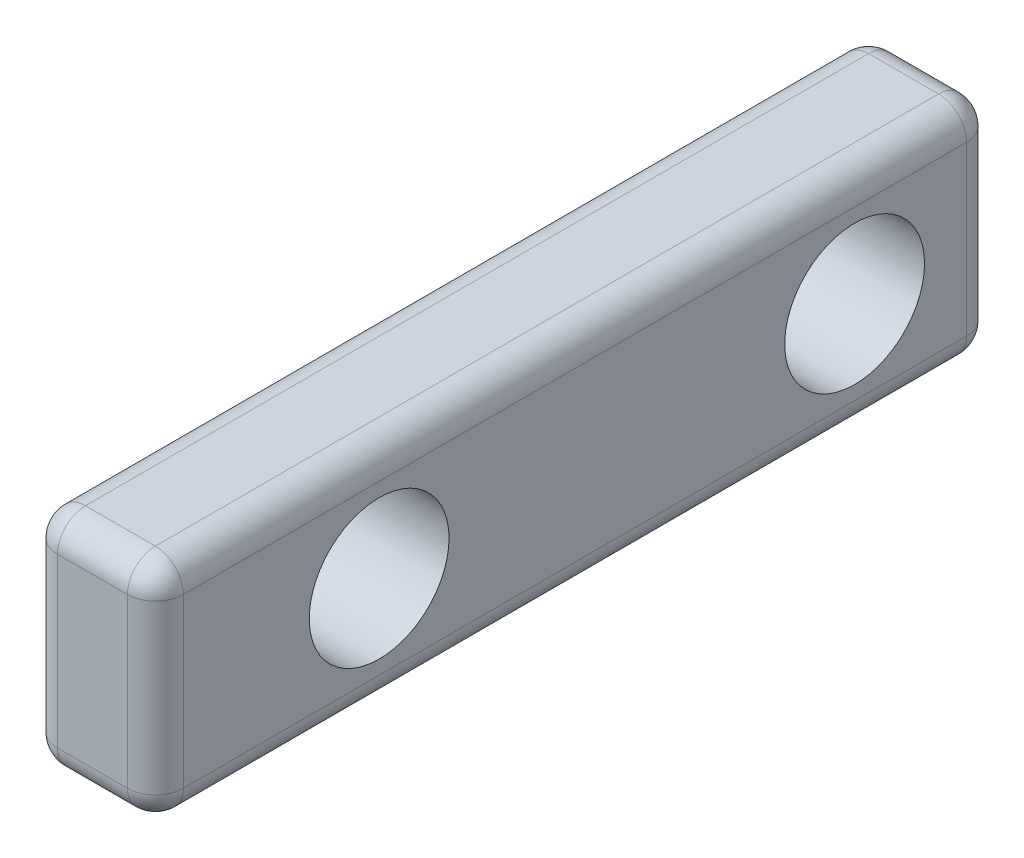
ISO-10303-21;
HEADER;
FILE_DESCRIPTION(('STEP AP214'),'2;1');
FILE_NAME('part.step','',(''),(''),'','','');
FILE_SCHEMA(('AUTOMOTIVE_DESIGN { 1 0 10303 214 1 1 1 1 }'));
ENDSEC;
DATA;
#1=APPLICATION_CONTEXT('core data for automotive mechanical design processes');
#2=APPLICATION_PROTOCOL_DEFINITION('international standard','automotive_design',2000,#1);
#3=PRODUCT_CONTEXT('',#1,'mechanical');
#4=PRODUCT('Part','Part','',(#3));
#5=PRODUCT_RELATED_PRODUCT_CATEGORY('part','',(#4));
#6=PRODUCT_DEFINITION_FORMATION('','',#4);
#7=PRODUCT_DEFINITION_CONTEXT('part definition',#1,'design');
#8=PRODUCT_DEFINITION('design','',#6,#7);
#9=PRODUCT_DEFINITION_SHAPE('','',#8);
#10=(LENGTH_UNIT() NAMED_UNIT(*) SI_UNIT(.MILLI.,.METRE.));
#11=(NAMED_UNIT(*) PLANE_ANGLE_UNIT() SI_UNIT($,.RADIAN.));
#12=(NAMED_UNIT(*) SI_UNIT($,.STERADIAN.) SOLID_ANGLE_UNIT());
#13=UNCERTAINTY_MEASURE_WITH_UNIT(LENGTH_MEASURE(1.E-05),#10,'distance_accuracy_value','');
#14=(GEOMETRIC_REPRESENTATION_CONTEXT(3) GLOBAL_UNCERTAINTY_ASSIGNED_CONTEXT((#13)) GLOBAL_UNIT_ASSIGNED_CONTEXT((#10,
#11,#12)) REPRESENTATION_CONTEXT('',''));
#15=CARTESIAN_POINT('',(0.,0.,0.));
#16=DIRECTION('',(0.,0.,1.));
#17=DIRECTION('',(1.,0.,0.));
#18=AXIS2_PLACEMENT_3D('',#15,#16,#17);
#19=CARTESIAN_POINT('',(0.,8.,30.));
#20=DIRECTION('',(1.,0.,0.));
#21=DIRECTION('',(0.,0.,-1.));
#22=AXIS2_PLACEMENT_3D('',#19,#20,#21);
#23=PLANE('',#22);
#24=CARTESIAN_POINT('',(0.,4.,5.));
#25=DIRECTION('',(-1.,0.,0.));
#26=DIRECTION('',(0.,0.,1.));
#27=AXIS2_PLACEMENT_3D('',#24,#25,#26);
#28=CIRCLE('',#27,3.5);
#29=CARTESIAN_POINT('',(0.,1.,6.802775637732));
#30=VERTEX_POINT('',#29);
#31=CARTESIAN_POINT('',(0.,7.,6.802775637732));
#32=VERTEX_POINT('',#31);
#33=EDGE_CURVE('E454',#30,#32,#28,.T.);
#34=ORIENTED_EDGE('',*,*,#33,.F.);
#35=DIRECTION('',(0.,0.,-1.));
#36=VECTOR('',#35,1.);
#37=CARTESIAN_POINT('',(0.,1.,30.));
#38=LINE('',#37,#36);
#39=CARTESIAN_POINT('',(0.,1.,20.197224362268));
#40=VERTEX_POINT('',#39);
#41=EDGE_CURVE('E206',#30,#40,#38,.F.);
#42=ORIENTED_EDGE('',*,*,#41,.T.);
#43=CARTESIAN_POINT('',(0.,4.,22.));
#44=DIRECTION('',(-1.,0.,0.));
#45=DIRECTION('',(0.,0.,1.));
#46=AXIS2_PLACEMENT_3D('',#43,#44,#45);
#47=CIRCLE('',#46,3.5);
#48=CARTESIAN_POINT('',(0.,7.,20.197224362268));
#49=VERTEX_POINT('',#48);
#50=EDGE_CURVE('E396',#49,#40,#47,.T.);
#51=ORIENTED_EDGE('',*,*,#50,.F.);
#52=DIRECTION('',(0.,0.,-1.));
#53=VECTOR('',#52,1.);
#54=CARTESIAN_POINT('',(0.,7.,30.));
#55=LINE('',#54,#53);
#56=EDGE_CURVE('E198',#49,#32,#55,.T.);
#57=ORIENTED_EDGE('',*,*,#56,.T.);
#58=EDGE_LOOP('',(#34,#42,#51,#57));
#59=FACE_BOUND('',#58,.T.);
#60=ADVANCED_FACE('F39',(#59),#23,.F.);
#61=CARTESIAN_POINT('',(0.,1.,23.802775637732));
#62=VERTEX_POINT('',#61);
#63=CARTESIAN_POINT('',(0.,7.,23.802775637732));
#64=VERTEX_POINT('',#63);
#65=EDGE_CURVE('E391',#62,#64,#47,.T.);
#66=ORIENTED_EDGE('',*,*,#65,.F.);
#67=DIRECTION('',(0.,0.,-1.));
#68=VECTOR('',#67,1.);
#69=CARTESIAN_POINT('',(0.,1.,30.));
#70=LINE('',#69,#68);
#71=CARTESIAN_POINT('',(0.,1.,29.));
#72=VERTEX_POINT('',#71);
#73=EDGE_CURVE('E204',#62,#72,#70,.F.);
#74=ORIENTED_EDGE('',*,*,#73,.T.);
#75=DIRECTION('',(0.,-1.,0.));
#76=VECTOR('',#75,1.);
#77=CARTESIAN_POINT('',(0.,8.,29.));
#78=LINE('',#77,#76);
#79=CARTESIAN_POINT('',(0.,7.,29.));
#80=VERTEX_POINT('',#79);
#81=EDGE_CURVE('E202',#72,#80,#78,.F.);
#82=ORIENTED_EDGE('',*,*,#81,.T.);
#83=DIRECTION('',(0.,0.,-1.));
#84=VECTOR('',#83,1.);
#85=CARTESIAN_POINT('',(0.,7.,30.));
#86=LINE('',#85,#84);
#87=EDGE_CURVE('E200',#80,#64,#86,.T.);
#88=ORIENTED_EDGE('',*,*,#87,.T.);
#89=EDGE_LOOP('',(#66,#74,#82,#88));
#90=FACE_BOUND('',#89,.T.);
#91=ADVANCED_FACE('F305',(#90),#23,.F.);
#92=CARTESIAN_POINT('',(0.,4.,22.));
#93=DIRECTION('',(1.,0.,0.));
#94=DIRECTION('',(0.,0.,-1.));
#95=AXIS2_PLACEMENT_3D('',#92,#93,#94);
#96=CYLINDRICAL_SURFACE('',#95,2.5);
#97=CARTESIAN_POINT('',(4.5,4.,22.));
#98=DIRECTION('',(1.,0.,0.));
#99=DIRECTION('',(0.,0.,-1.));
#100=AXIS2_PLACEMENT_3D('',#97,#98,#99);
#101=CIRCLE('',#100,2.5);
#102=CARTESIAN_POINT('',(4.5,4.,19.5));
#103=VERTEX_POINT('',#102);
#104=EDGE_CURVE('E402',#103,#103,#101,.T.);
#105=ORIENTED_EDGE('',*,*,#104,.T.);
#106=EDGE_LOOP('',(#105));
#107=FACE_BOUND('',#106,.T.);
#108=CARTESIAN_POINT('',(0.5,4.,22.));
#109=DIRECTION('',(-1.,0.,0.));
#110=DIRECTION('',(0.,0.,1.));
#111=AXIS2_PLACEMENT_3D('',#108,#109,#110);
#112=CIRCLE('',#111,2.5);
#113=CARTESIAN_POINT('',(0.5,4.,24.5));
#114=VERTEX_POINT('',#113);
#115=EDGE_CURVE('E405',#114,#114,#112,.F.);
#116=ORIENTED_EDGE('',*,*,#115,.F.);
#117=EDGE_LOOP('',(#116));
#118=FACE_BOUND('',#117,.T.);
#119=ADVANCED_FACE('F310',(#107,#118),#96,.F.);
#120=CARTESIAN_POINT('',(0.,4.,5.));
#121=DIRECTION('',(1.,0.,0.));
#122=DIRECTION('',(0.,0.,-1.));
#123=AXIS2_PLACEMENT_3D('',#120,#121,#122);
#124=CYLINDRICAL_SURFACE('',#123,2.5);
#125=CARTESIAN_POINT('',(4.5,4.,5.));
#126=DIRECTION('',(1.,0.,0.));
#127=DIRECTION('',(0.,0.,-1.));
#128=AXIS2_PLACEMENT_3D('',#125,#126,#127);
#129=CIRCLE('',#128,2.5);
#130=CARTESIAN_POINT('',(4.5,4.,2.5));
#131=VERTEX_POINT('',#130);
#132=EDGE_CURVE('E183',#131,#131,#129,.T.);
#133=ORIENTED_EDGE('',*,*,#132,.T.);
#134=EDGE_LOOP('',(#133));
#135=FACE_BOUND('',#134,.T.);
#136=CARTESIAN_POINT('',(0.5,4.,5.));
#137=DIRECTION('',(-1.,0.,0.));
#138=DIRECTION('',(0.,0.,1.));
#139=AXIS2_PLACEMENT_3D('',#136,#137,#138);
#140=CIRCLE('',#139,2.5);
#141=CARTESIAN_POINT('',(0.5,4.,7.5));
#142=VERTEX_POINT('',#141);
#143=EDGE_CURVE('E406',#142,#142,#140,.F.);
#144=ORIENTED_EDGE('',*,*,#143,.F.);
#145=EDGE_LOOP('',(#144));
#146=FACE_BOUND('',#145,.T.);
#147=ADVANCED_FACE('F314',(#135,#146),#124,.F.);
#148=DIRECTION('',(0.,-1.,0.));
#149=VECTOR('',#148,1.);
#150=CARTESIAN_POINT('',(0.,8.,1.));
#151=LINE('',#150,#149);
#152=CARTESIAN_POINT('',(0.,7.,1.));
#153=VERTEX_POINT('',#152);
#154=CARTESIAN_POINT('',(0.,1.,1.));
#155=VERTEX_POINT('',#154);
#156=EDGE_CURVE('E190',#153,#155,#151,.T.);
#157=ORIENTED_EDGE('',*,*,#156,.T.);
#158=DIRECTION('',(0.,0.,-1.));
#159=VECTOR('',#158,1.);
#160=CARTESIAN_POINT('',(0.,1.,30.));
#161=LINE('',#160,#159);
#162=CARTESIAN_POINT('',(0.,1.,3.197224362268));
#163=VERTEX_POINT('',#162);
#164=EDGE_CURVE('E160',#155,#163,#161,.F.);
#165=ORIENTED_EDGE('',*,*,#164,.T.);
#166=CARTESIAN_POINT('',(0.,7.,3.197224362268));
#167=VERTEX_POINT('',#166);
#168=EDGE_CURVE('E452',#167,#163,#28,.T.);
#169=ORIENTED_EDGE('',*,*,#168,.F.);
#170=DIRECTION('',(0.,0.,-1.));
#171=VECTOR('',#170,1.);
#172=CARTESIAN_POINT('',(0.,7.,30.));
#173=LINE('',#172,#171);
#174=EDGE_CURVE('E195',#167,#153,#173,.T.);
#175=ORIENTED_EDGE('',*,*,#174,.T.);
#176=EDGE_LOOP('',(#157,#165,#169,#175));
#177=FACE_BOUND('',#176,.T.);
#178=ADVANCED_FACE('F261',(#177),#23,.F.);
#179=CARTESIAN_POINT('',(0.,0.,30.));
#180=DIRECTION('',(0.,1.,0.));
#181=DIRECTION('',(0.,0.,1.));
#182=AXIS2_PLACEMENT_3D('',#179,#180,#181);
#183=PLANE('',#182);
#184=DIRECTION('',(0.,0.,-1.));
#185=VECTOR('',#184,1.);
#186=CARTESIAN_POINT('',(3.5,0.,30.));
#187=LINE('',#186,#185);
#188=CARTESIAN_POINT('',(3.5,0.,1.));
#189=VERTEX_POINT('',#188);
#190=CARTESIAN_POINT('',(3.5,0.,29.));
#191=VERTEX_POINT('',#190);
#192=EDGE_CURVE('E182',#189,#191,#187,.F.);
#193=ORIENTED_EDGE('',*,*,#192,.T.);
#194=DIRECTION('',(1.,0.,0.));
#195=VECTOR('',#194,1.);
#196=CARTESIAN_POINT('',(0.,0.,29.));
#197=LINE('',#196,#195);
#198=CARTESIAN_POINT('',(1.,0.,29.));
#199=VERTEX_POINT('',#198);
#200=EDGE_CURVE('E187',#191,#199,#197,.F.);
#201=ORIENTED_EDGE('',*,*,#200,.T.);
#202=DIRECTION('',(0.,0.,-1.));
#203=VECTOR('',#202,1.);
#204=CARTESIAN_POINT('',(1.,0.,30.));
#205=LINE('',#204,#203);
#206=CARTESIAN_POINT('',(1.,0.,1.));
#207=VERTEX_POINT('',#206);
#208=EDGE_CURVE('E158',#199,#207,#205,.T.);
#209=ORIENTED_EDGE('',*,*,#208,.T.);
#210=DIRECTION('',(1.,0.,0.));
#211=VECTOR('',#210,1.);
#212=CARTESIAN_POINT('',(0.,0.,1.));
#213=LINE('',#212,#211);
#214=EDGE_CURVE('E176',#207,#189,#213,.T.);
#215=ORIENTED_EDGE('',*,*,#214,.T.);
#216=EDGE_LOOP('',(#193,#201,#209,#215));
#217=FACE_BOUND('',#216,.T.);
#218=ADVANCED_FACE('F185',(#217),#183,.F.);
#219=CARTESIAN_POINT('',(4.5,8.,30.));
#220=DIRECTION('',(-1.,0.,0.));
#221=DIRECTION('',(0.,-1.,0.));
#222=AXIS2_PLACEMENT_3D('',#219,#220,#221);
#223=PLANE('',#222);
#224=DIRECTION('',(0.,1.,0.));
#225=VECTOR('',#224,1.);
#226=CARTESIAN_POINT('',(4.5,0.,29.));
#227=LINE('',#226,#225);
#228=CARTESIAN_POINT('',(4.5,7.,29.));
#229=VERTEX_POINT('',#228);
#230=CARTESIAN_POINT('',(4.5,1.,29.));
#231=VERTEX_POINT('',#230);
#232=EDGE_CURVE('E438',#229,#231,#227,.F.);
#233=ORIENTED_EDGE('',*,*,#232,.T.);
#234=DIRECTION('',(0.,0.,-1.));
#235=VECTOR('',#234,1.);
#236=CARTESIAN_POINT('',(4.5,1.,30.));
#237=LINE('',#236,#235);
#238=CARTESIAN_POINT('',(4.5,1.,1.));
#239=VERTEX_POINT('',#238);
#240=EDGE_CURVE('E511',#231,#239,#237,.T.);
#241=ORIENTED_EDGE('',*,*,#240,.T.);
#242=DIRECTION('',(0.,1.,0.));
#243=VECTOR('',#242,1.);
#244=CARTESIAN_POINT('',(4.5,8.,1.));
#245=LINE('',#244,#243);
#246=CARTESIAN_POINT('',(4.5,7.,1.));
#247=VERTEX_POINT('',#246);
#248=EDGE_CURVE('E255',#239,#247,#245,.T.);
#249=ORIENTED_EDGE('',*,*,#248,.T.);
#250=DIRECTION('',(0.,0.,-1.));
#251=VECTOR('',#250,1.);
#252=CARTESIAN_POINT('',(4.5,7.,30.));
#253=LINE('',#252,#251);
#254=EDGE_CURVE('E514',#247,#229,#253,.F.);
#255=ORIENTED_EDGE('',*,*,#254,.T.);
#256=EDGE_LOOP('',(#233,#241,#249,#255));
#257=FACE_BOUND('',#256,.T.);
#258=ORIENTED_EDGE('',*,*,#132,.F.);
#259=EDGE_LOOP('',(#258));
#260=FACE_BOUND('',#259,.T.);
#261=ORIENTED_EDGE('',*,*,#104,.F.);
#262=EDGE_LOOP('',(#261));
#263=FACE_BOUND('',#262,.T.);
#264=ADVANCED_FACE('F320',(#257,#260,#263),#223,.F.);
#265=CARTESIAN_POINT('',(0.,8.,30.));
#266=DIRECTION('',(0.,-1.,0.));
#267=DIRECTION('',(0.,0.,-1.));
#268=AXIS2_PLACEMENT_3D('',#265,#266,#267);
#269=PLANE('',#268);
#270=DIRECTION('',(-1.,0.,0.));
#271=VECTOR('',#270,1.);
#272=CARTESIAN_POINT('',(4.5,8.,29.));
#273=LINE('',#272,#271);
#274=CARTESIAN_POINT('',(1.,8.,29.));
#275=VERTEX_POINT('',#274);
#276=CARTESIAN_POINT('',(3.5,8.,29.));
#277=VERTEX_POINT('',#276);
#278=EDGE_CURVE('E490',#275,#277,#273,.F.);
#279=ORIENTED_EDGE('',*,*,#278,.T.);
#280=DIRECTION('',(0.,0.,-1.));
#281=VECTOR('',#280,1.);
#282=CARTESIAN_POINT('',(3.5,8.,30.));
#283=LINE('',#282,#281);
#284=CARTESIAN_POINT('',(3.5,8.,1.));
#285=VERTEX_POINT('',#284);
#286=EDGE_CURVE('E492',#277,#285,#283,.T.);
#287=ORIENTED_EDGE('',*,*,#286,.T.);
#288=DIRECTION('',(-1.,0.,0.));
#289=VECTOR('',#288,1.);
#290=CARTESIAN_POINT('',(0.,8.,1.));
#291=LINE('',#290,#289);
#292=CARTESIAN_POINT('',(1.,8.,1.));
#293=VERTEX_POINT('',#292);
#294=EDGE_CURVE('E481',#285,#293,#291,.T.);
#295=ORIENTED_EDGE('',*,*,#294,.T.);
#296=DIRECTION('',(0.,0.,-1.));
#297=VECTOR('',#296,1.);
#298=CARTESIAN_POINT('',(1.,8.,30.));
#299=LINE('',#298,#297);
#300=EDGE_CURVE('E488',#293,#275,#299,.F.);
#301=ORIENTED_EDGE('',*,*,#300,.T.);
#302=EDGE_LOOP('',(#279,#287,#295,#301));
#303=FACE_BOUND('',#302,.T.);
#304=ADVANCED_FACE('F424',(#303),#269,.F.);
#305=CARTESIAN_POINT('',(0.,0.,30.));
#306=DIRECTION('',(0.,0.,1.));
#307=DIRECTION('',(1.,0.,0.));
#308=AXIS2_PLACEMENT_3D('',#305,#306,#307);
#309=PLANE('',#308);
#310=DIRECTION('',(1.,0.,0.));
#311=VECTOR('',#310,1.);
#312=CARTESIAN_POINT('',(4.5,1.,30.));
#313=LINE('',#312,#311);
#314=CARTESIAN_POINT('',(1.,1.,30.));
#315=VERTEX_POINT('',#314);
#316=CARTESIAN_POINT('',(3.5,1.,30.));
#317=VERTEX_POINT('',#316);
#318=EDGE_CURVE('E474',#315,#317,#313,.T.);
#319=ORIENTED_EDGE('',*,*,#318,.T.);
#320=DIRECTION('',(0.,1.,0.));
#321=VECTOR('',#320,1.);
#322=CARTESIAN_POINT('',(3.5,8.,30.));
#323=LINE('',#322,#321);
#324=CARTESIAN_POINT('',(3.5,7.,30.));
#325=VERTEX_POINT('',#324);
#326=EDGE_CURVE('E478',#317,#325,#323,.T.);
#327=ORIENTED_EDGE('',*,*,#326,.T.);
#328=DIRECTION('',(-1.,0.,0.));
#329=VECTOR('',#328,1.);
#330=CARTESIAN_POINT('',(0.,7.,30.));
#331=LINE('',#330,#329);
#332=CARTESIAN_POINT('',(1.,7.,30.));
#333=VERTEX_POINT('',#332);
#334=EDGE_CURVE('E483',#325,#333,#331,.T.);
#335=ORIENTED_EDGE('',*,*,#334,.T.);
#336=DIRECTION('',(0.,-1.,0.));
#337=VECTOR('',#336,1.);
#338=CARTESIAN_POINT('',(1.,0.,30.));
#339=LINE('',#338,#337);
#340=EDGE_CURVE('E479',#333,#315,#339,.T.);
#341=ORIENTED_EDGE('',*,*,#340,.T.);
#342=EDGE_LOOP('',(#319,#327,#335,#341));
#343=FACE_BOUND('',#342,.T.);
#344=ADVANCED_FACE('F420',(#343),#309,.T.);
#345=CARTESIAN_POINT('',(0.,0.,0.));
#346=DIRECTION('',(0.,0.,1.));
#347=DIRECTION('',(1.,0.,0.));
#348=AXIS2_PLACEMENT_3D('',#345,#346,#347);
#349=PLANE('',#348);
#350=DIRECTION('',(0.,1.,0.));
#351=VECTOR('',#350,1.);
#352=CARTESIAN_POINT('',(3.5,0.,0.));
#353=LINE('',#352,#351);
#354=CARTESIAN_POINT('',(3.5,7.,0.));
#355=VERTEX_POINT('',#354);
#356=CARTESIAN_POINT('',(3.5,1.,0.));
#357=VERTEX_POINT('',#356);
#358=EDGE_CURVE('E48',#355,#357,#353,.F.);
#359=ORIENTED_EDGE('',*,*,#358,.T.);
#360=DIRECTION('',(1.,0.,0.));
#361=VECTOR('',#360,1.);
#362=CARTESIAN_POINT('',(0.,1.,0.));
#363=LINE('',#362,#361);
#364=CARTESIAN_POINT('',(1.,1.,0.));
#365=VERTEX_POINT('',#364);
#366=EDGE_CURVE('E11',#357,#365,#363,.F.);
#367=ORIENTED_EDGE('',*,*,#366,.T.);
#368=DIRECTION('',(0.,-1.,0.));
#369=VECTOR('',#368,1.);
#370=CARTESIAN_POINT('',(1.,0.,0.));
#371=LINE('',#370,#369);
#372=CARTESIAN_POINT('',(1.,7.,0.));
#373=VERTEX_POINT('',#372);
#374=EDGE_CURVE('E328',#365,#373,#371,.F.);
#375=ORIENTED_EDGE('',*,*,#374,.T.);
#376=DIRECTION('',(-1.,0.,0.));
#377=VECTOR('',#376,1.);
#378=CARTESIAN_POINT('',(0.,7.,0.));
#379=LINE('',#378,#377);
#380=EDGE_CURVE('E59',#373,#355,#379,.F.);
#381=ORIENTED_EDGE('',*,*,#380,.T.);
#382=EDGE_LOOP('',(#359,#367,#375,#381));
#383=FACE_BOUND('',#382,.T.);
#384=ADVANCED_FACE('F423',(#383),#349,.F.);
#385=CARTESIAN_POINT('',(0.5,4.,5.));
#386=DIRECTION('',(-1.,0.,0.));
#387=DIRECTION('',(0.,0.,1.));
#388=AXIS2_PLACEMENT_3D('',#385,#386,#387);
#389=PLANE('',#388);
#390=CARTESIAN_POINT('',(0.5,4.,5.));
#391=DIRECTION('',(-1.,0.,0.));
#392=DIRECTION('',(0.,0.,1.));
#393=AXIS2_PLACEMENT_3D('',#390,#391,#392);
#394=CIRCLE('',#393,3.5);
#395=CARTESIAN_POINT('',(0.5,4.,8.5));
#396=VERTEX_POINT('',#395);
#397=EDGE_CURVE('E409',#396,#396,#394,.T.);
#398=ORIENTED_EDGE('',*,*,#397,.T.);
#399=EDGE_LOOP('',(#398));
#400=FACE_BOUND('',#399,.T.);
#401=ORIENTED_EDGE('',*,*,#143,.T.);
#402=EDGE_LOOP('',(#401));
#403=FACE_BOUND('',#402,.T.);
#404=ADVANCED_FACE('F233',(#400,#403),#389,.T.);
#405=CARTESIAN_POINT('',(0.5,4.,5.));
#406=DIRECTION('',(-1.,0.,0.));
#407=DIRECTION('',(0.,0.,1.));
#408=AXIS2_PLACEMENT_3D('',#405,#406,#407);
#409=CYLINDRICAL_SURFACE('',#408,3.5);
#410=ORIENTED_EDGE('',*,*,#397,.F.);
#411=EDGE_LOOP('',(#410));
#412=FACE_BOUND('',#411,.T.);
#413=ORIENTED_EDGE('',*,*,#168,.T.);
#414=CARTESIAN_POINT('',(0.,1.,3.197224362268));
#415=CARTESIAN_POINT('',(4.05951234376222E-05,0.957179579187127,3.2684690276151));
#416=CARTESIAN_POINT('',(0.00274598049350684,0.916954582336867,3.34116816068963));
#417=CARTESIAN_POINT('',(0.0118454243798904,0.841896788586979,3.48896372851402));
#418=CARTESIAN_POINT('',(0.0182344142756212,0.80705666549464,3.56405673544346));
#419=CARTESIAN_POINT('',(0.0331034224374195,0.742703677815045,3.71667708052777));
#420=CARTESIAN_POINT('',(0.0415929400136458,0.713216099665096,3.79421404116378));
#421=CARTESIAN_POINT('',(0.0592180189432897,0.659822188606181,3.95115107227599));
#422=CARTESIAN_POINT('',(0.0683538692138188,0.635918372495684,4.03055196521593));
#423=CARTESIAN_POINT('',(0.086814208205259,0.5916823795177,4.19894613296531));
#424=CARTESIAN_POINT('',(0.096066281667716,0.571945999945479,4.2881049416193));
#425=CARTESIAN_POINT('',(0.112165671160979,0.539478024378625,4.46790107598855));
#426=CARTESIAN_POINT('',(0.119013345539773,0.52674538439688,4.55853817927213));
#427=CARTESIAN_POINT('',(0.129089883719479,0.508444949212294,4.74044369118192));
#428=CARTESIAN_POINT('',(0.132330563646499,0.502853750480257,4.8317090471198));
#429=CARTESIAN_POINT('',(0.134643572713677,0.498837000908929,5.01444797792208));
#430=CARTESIAN_POINT('',(0.133716170026013,0.500410989065478,5.10592153901219));
#431=CARTESIAN_POINT('',(0.127908262985011,0.510624679269247,5.2869897895417));
#432=CARTESIAN_POINT('',(0.123085955252605,0.519160379562508,5.37659235508552));
#433=CARTESIAN_POINT('',(0.110399410923065,0.543062434341128,5.55466900329641));
#434=CARTESIAN_POINT('',(0.102534540760572,0.558430211597633,5.64314284695874));
#435=CARTESIAN_POINT('',(0.0850524538621382,0.595898993138104,5.81863394534421));
#436=CARTESIAN_POINT('',(0.0754321600120079,0.618011867477833,5.90564834462198));
#437=CARTESIAN_POINT('',(0.0560320950073541,0.668844268691254,6.07770726253581));
#438=CARTESIAN_POINT('',(0.046252306287668,0.697564527863665,6.1627515616742));
#439=CARTESIAN_POINT('',(0.0269543891561955,0.7662525346544,6.34293909496165));
#440=CARTESIAN_POINT('',(0.0176874107885601,0.807254250682241,6.43772270752275));
#441=CARTESIAN_POINT('',(0.00758573529076609,0.874971875166249,6.57697675338798));
#442=CARTESIAN_POINT('',(0.00485268858931609,0.898547155739455,6.62285273098284));
#443=CARTESIAN_POINT('',(0.00106228103195127,0.947748945589155,6.71360172410194));
#444=CARTESIAN_POINT('',(6.11361507090593E-06,0.973376902146048,6.75847400291878));
#445=CARTESIAN_POINT('',(0.,1.,6.802775637732));
#446=B_SPLINE_CURVE_WITH_KNOTS('',3,(#414,#415,#416,#417,#418,#419,#420,#421,#422,#423,#424,
#425,#426,#427,#428,#429,#430,#431,#432,#433,#434,#435,#436,#437,#438,#439,#440,#441,#442,#443,
#444,#445),.UNSPECIFIED.,.F.,.F.,(4,2,2,2,2,2,2,2,2,2,2,2,2,2,2,4),(0.,0.249147999335523,
0.497953987739899,0.747906414524426,0.997971287223848,1.27303052638857,1.54804875372407,
1.82216337471817,2.09626035957851,2.36633599500094,2.63646789968819,2.90707795360593,
3.17771801378922,3.48825886857255,3.64314524558775,3.79814180627766),.UNSPECIFIED.);
#447=EDGE_CURVE('E216',#163,#30,#446,.T.);
#448=ORIENTED_EDGE('',*,*,#447,.T.);
#449=ORIENTED_EDGE('',*,*,#33,.T.);
#450=CARTESIAN_POINT('',(0.,7.,6.802775637732));
#451=CARTESIAN_POINT('',(4.05951234379621E-05,7.04282042081287,6.7315309723849));
#452=CARTESIAN_POINT('',(0.00274598049350713,7.08304541766313,6.65883183931037));
#453=CARTESIAN_POINT('',(0.0118454243798905,7.15810321141302,6.51103627148598));
#454=CARTESIAN_POINT('',(0.0182344142756211,7.19294333450536,6.43594326455654));
#455=CARTESIAN_POINT('',(0.0331034224374195,7.25729632218496,6.28332291947224));
#456=CARTESIAN_POINT('',(0.041592940013646,7.28678390033491,6.20578595883622));
#457=CARTESIAN_POINT('',(0.05921801894329,7.34017781139382,6.04884892772402));
#458=CARTESIAN_POINT('',(0.0683538692138189,7.36408162750432,5.96944803478408));
#459=CARTESIAN_POINT('',(0.086814208205259,7.4083176204823,5.80105386703469));
#460=CARTESIAN_POINT('',(0.0960662816677163,7.42805400005452,5.7118950583807));
#461=CARTESIAN_POINT('',(0.112165671160979,7.46052197562138,5.53209892401145));
#462=CARTESIAN_POINT('',(0.119013345539774,7.47325461560312,5.44146182072787));
#463=CARTESIAN_POINT('',(0.12908988371948,7.49155505078771,5.25955630881809));
#464=CARTESIAN_POINT('',(0.1323305636465,7.49714624951974,5.1682909528802));
#465=CARTESIAN_POINT('',(0.134643572713678,7.50116299909107,4.98555202207793));
#466=CARTESIAN_POINT('',(0.133716170026014,7.49958901093452,4.89407846098782));
#467=CARTESIAN_POINT('',(0.127908262985012,7.48937532073075,4.7130102104583));
#468=CARTESIAN_POINT('',(0.123085955252606,7.4808396204375,4.62340764491448));
#469=CARTESIAN_POINT('',(0.110399410923066,7.45693756565888,4.44533099670359));
#470=CARTESIAN_POINT('',(0.102534540760574,7.44156978840237,4.35685715304126));
#471=CARTESIAN_POINT('',(0.0850524538621396,7.4041010068619,4.1813660546558));
#472=CARTESIAN_POINT('',(0.0754321600120092,7.38198813252217,4.09435165537803));
#473=CARTESIAN_POINT('',(0.0560320950073553,7.33115573130875,3.9222927374642));
#474=CARTESIAN_POINT('',(0.0462523062876691,7.30243547213634,3.8372484383258));
#475=CARTESIAN_POINT('',(0.026954389156196,7.2337474653456,3.65706090503835));
#476=CARTESIAN_POINT('',(0.0176874107885601,7.19274574931776,3.56227729247726));
#477=CARTESIAN_POINT('',(0.00758573529076625,7.12502812483375,3.42302324661202));
#478=CARTESIAN_POINT('',(0.00485268858931645,7.10145284426055,3.37714726901716));
#479=CARTESIAN_POINT('',(0.00106228103195177,7.05225105441085,3.28639827589806));
#480=CARTESIAN_POINT('',(6.11361507135414E-06,7.02662309785395,3.24152599708122));
#481=CARTESIAN_POINT('',(0.,7.,3.197224362268));
#482=B_SPLINE_CURVE_WITH_KNOTS('',3,(#450,#451,#452,#453,#454,#455,#456,#457,#458,#459,#460,
#461,#462,#463,#464,#465,#466,#467,#468,#469,#470,#471,#472,#473,#474,#475,#476,#477,#478,#479,
#480,#481),.UNSPECIFIED.,.F.,.F.,(4,2,2,2,2,2,2,2,2,2,2,2,2,2,2,4),(0.,0.249147999335523,
0.497953987739899,0.747906414524425,0.997971287223845,1.27303052638856,1.54804875372407,
1.82216337471817,2.09626035957851,2.36633599500094,2.63646789968819,2.90707795360593,
3.17771801378922,3.48825886857255,3.64314524558775,3.79814180627767),.UNSPECIFIED.);
#483=EDGE_CURVE('E208',#32,#167,#482,.T.);
#484=ORIENTED_EDGE('',*,*,#483,.T.);
#485=EDGE_LOOP('',(#413,#448,#449,#484));
#486=FACE_BOUND('',#485,.T.);
#487=ADVANCED_FACE('F227',(#412,#486),#409,.F.);
#488=CARTESIAN_POINT('',(0.5,4.,22.));
#489=DIRECTION('',(-1.,0.,0.));
#490=DIRECTION('',(0.,0.,1.));
#491=AXIS2_PLACEMENT_3D('',#488,#489,#490);
#492=PLANE('',#491);
#493=CARTESIAN_POINT('',(0.5,4.,22.));
#494=DIRECTION('',(-1.,0.,0.));
#495=DIRECTION('',(0.,0.,1.));
#496=AXIS2_PLACEMENT_3D('',#493,#494,#495);
#497=CIRCLE('',#496,3.5);
#498=CARTESIAN_POINT('',(0.5,4.,25.5));
#499=VERTEX_POINT('',#498);
#500=EDGE_CURVE('E385',#499,#499,#497,.T.);
#501=ORIENTED_EDGE('',*,*,#500,.T.);
#502=EDGE_LOOP('',(#501));
#503=FACE_BOUND('',#502,.T.);
#504=ORIENTED_EDGE('',*,*,#115,.T.);
#505=EDGE_LOOP('',(#504));
#506=FACE_BOUND('',#505,.T.);
#507=ADVANCED_FACE('F232',(#503,#506),#492,.T.);
#508=CARTESIAN_POINT('',(0.5,4.,22.));
#509=DIRECTION('',(-1.,0.,0.));
#510=DIRECTION('',(0.,0.,1.));
#511=AXIS2_PLACEMENT_3D('',#508,#509,#510);
#512=CYLINDRICAL_SURFACE('',#511,3.5);
#513=ORIENTED_EDGE('',*,*,#500,.F.);
#514=EDGE_LOOP('',(#513));
#515=FACE_BOUND('',#514,.T.);
#516=ORIENTED_EDGE('',*,*,#50,.T.);
#517=CARTESIAN_POINT('',(0.,1.,20.197224362268));
#518=CARTESIAN_POINT('',(4.05951234379235E-05,0.957179579187126,20.2684690276151));
#519=CARTESIAN_POINT('',(0.00274598049350705,0.916954582336866,20.3411681606896));
#520=CARTESIAN_POINT('',(0.0118454243798904,0.841896788586978,20.488963728514));
#521=CARTESIAN_POINT('',(0.018234414275621,0.80705666549464,20.5640567354435));
#522=CARTESIAN_POINT('',(0.0331034224374197,0.742703677815044,20.7166770805278));
#523=CARTESIAN_POINT('',(0.0415929400136464,0.713216099665094,20.7942140411638));
#524=CARTESIAN_POINT('',(0.0592180189432904,0.659822188606179,20.951151072276));
#525=CARTESIAN_POINT('',(0.0683538692138191,0.635918372495683,21.0305519652159));
#526=CARTESIAN_POINT('',(0.0868142082052589,0.5916823795177,21.1989461329653));
#527=CARTESIAN_POINT('',(0.0960662816677161,0.571945999945479,21.2881049416193));
#528=CARTESIAN_POINT('',(0.112165671160979,0.539478024378626,21.4679010759886));
#529=CARTESIAN_POINT('',(0.119013345539773,0.52674538439688,21.5585381792721));
#530=CARTESIAN_POINT('',(0.129089883719479,0.508444949212294,21.7404436911819));
#531=CARTESIAN_POINT('',(0.132330563646498,0.502853750480258,21.8317090471198));
#532=CARTESIAN_POINT('',(0.134643572713676,0.49883700090893,22.0144479779221));
#533=CARTESIAN_POINT('',(0.133716170026013,0.500410989065479,22.1059215390122));
#534=CARTESIAN_POINT('',(0.12790826298501,0.510624679269249,22.2869897895417));
#535=CARTESIAN_POINT('',(0.123085955252604,0.51916037956251,22.3765923550855));
#536=CARTESIAN_POINT('',(0.110399410923063,0.543062434341131,22.5546690032964));
#537=CARTESIAN_POINT('',(0.102534540760571,0.558430211597637,22.6431428469587));
#538=CARTESIAN_POINT('',(0.0850524538621367,0.595898993138108,22.8186339453442));
#539=CARTESIAN_POINT('',(0.0754321600120062,0.618011867477837,22.905648344622));
#540=CARTESIAN_POINT('',(0.0560320950073526,0.668844268691258,23.0777072625358));
#541=CARTESIAN_POINT('',(0.0462523062876667,0.697564527863669,23.1627515616742));
#542=CARTESIAN_POINT('',(0.0269543891561945,0.766252534654404,23.3429390949617));
#543=CARTESIAN_POINT('',(0.0176874107885591,0.807254250682245,23.4377227075228));
#544=CARTESIAN_POINT('',(0.00758573529076561,0.874971875166252,23.576976753388));
#545=CARTESIAN_POINT('',(0.00485268858931582,0.898547155739458,23.6228527309828));
#546=CARTESIAN_POINT('',(0.00106228103195118,0.947748945589157,23.7136017241019));
#547=CARTESIAN_POINT('',(6.11361507084471E-06,0.973376902146051,23.7584740029188));
#548=CARTESIAN_POINT('',(0.,1.,23.802775637732));
#549=B_SPLINE_CURVE_WITH_KNOTS('',3,(#517,#518,#519,#520,#521,#522,#523,#524,#525,#526,#527,
#528,#529,#530,#531,#532,#533,#534,#535,#536,#537,#538,#539,#540,#541,#542,#543,#544,#545,#546,
#547,#548),.UNSPECIFIED.,.F.,.F.,(4,2,2,2,2,2,2,2,2,2,2,2,2,2,2,4),(0.,0.249147999335526,
0.497953987739905,0.747906414524434,0.997971287223854,1.27303052638857,1.54804875372408,
1.82216337471817,2.09626035957852,2.36633599500095,2.6364678996882,2.90707795360594,
3.17771801378923,3.48825886857256,3.64314524558775,3.79814180627766),.UNSPECIFIED.);
#550=EDGE_CURVE('E249',#40,#62,#549,.T.);
#551=ORIENTED_EDGE('',*,*,#550,.T.);
#552=ORIENTED_EDGE('',*,*,#65,.T.);
#553=CARTESIAN_POINT('',(0.,7.,23.802775637732));
#554=CARTESIAN_POINT('',(4.05951234376769E-05,7.04282042081287,23.7315309723849));
#555=CARTESIAN_POINT('',(0.00274598049350684,7.08304541766313,23.6588318393104));
#556=CARTESIAN_POINT('',(0.0118454243798902,7.15810321141302,23.511036271486));
#557=CARTESIAN_POINT('',(0.018234414275621,7.19294333450536,23.4359432645565));
#558=CARTESIAN_POINT('',(0.0331034224374194,7.25729632218495,23.2833229194722));
#559=CARTESIAN_POINT('',(0.0415929400136459,7.2867839003349,23.2057859588362));
#560=CARTESIAN_POINT('',(0.0592180189432899,7.34017781139382,23.048848927724));
#561=CARTESIAN_POINT('',(0.0683538692138191,7.36408162750432,22.9694480347841));
#562=CARTESIAN_POINT('',(0.0868142082052593,7.4083176204823,22.8010538670347));
#563=CARTESIAN_POINT('',(0.0960662816677164,7.42805400005452,22.7118950583807));
#564=CARTESIAN_POINT('',(0.112165671160979,7.46052197562137,22.5320989240114));
#565=CARTESIAN_POINT('',(0.119013345539774,7.47325461560312,22.4414618207279));
#566=CARTESIAN_POINT('',(0.12908988371948,7.49155505078771,22.2595563088181));
#567=CARTESIAN_POINT('',(0.132330563646499,7.49714624951974,22.1682909528802));
#568=CARTESIAN_POINT('',(0.134643572713677,7.50116299909107,21.9855520220779));
#569=CARTESIAN_POINT('',(0.133716170026014,7.49958901093452,21.8940784609878));
#570=CARTESIAN_POINT('',(0.127908262985011,7.48937532073075,21.7130102104583));
#571=CARTESIAN_POINT('',(0.123085955252605,7.48083962043749,21.6234076449145));
#572=CARTESIAN_POINT('',(0.110399410923065,7.45693756565887,21.4453309967036));
#573=CARTESIAN_POINT('',(0.102534540760572,7.44156978840237,21.3568571530413));
#574=CARTESIAN_POINT('',(0.0850524538621383,7.4041010068619,21.1813660546558));
#575=CARTESIAN_POINT('',(0.0754321600120079,7.38198813252217,21.094351655378));
#576=CARTESIAN_POINT('',(0.0560320950073541,7.33115573130875,20.9222927374642));
#577=CARTESIAN_POINT('',(0.0462523062876681,7.30243547213634,20.8372484383258));
#578=CARTESIAN_POINT('',(0.0269543891561953,7.2337474653456,20.6570609050383));
#579=CARTESIAN_POINT('',(0.0176874107885598,7.19274574931776,20.5622772924773));
#580=CARTESIAN_POINT('',(0.0075857352907661,7.12502812483375,20.423023246612));
#581=CARTESIAN_POINT('',(0.00485268858931626,7.10145284426054,20.3771472690172));
#582=CARTESIAN_POINT('',(0.00106228103195151,7.05225105441084,20.2863982758981));
#583=CARTESIAN_POINT('',(6.11361507108082E-06,7.02662309785395,20.2415259970812));
#584=CARTESIAN_POINT('',(0.,7.,20.197224362268));
#585=B_SPLINE_CURVE_WITH_KNOTS('',3,(#553,#554,#555,#556,#557,#558,#559,#560,#561,#562,#563,
#564,#565,#566,#567,#568,#569,#570,#571,#572,#573,#574,#575,#576,#577,#578,#579,#580,#581,#582,
#583,#584),.UNSPECIFIED.,.F.,.F.,(4,2,2,2,2,2,2,2,2,2,2,2,2,2,2,4),(0.,0.24914799933552,
0.497953987739896,0.747906414524427,0.997971287223847,1.27303052638857,1.54804875372407,
1.82216337471817,2.09626035957852,2.36633599500095,2.63646789968819,2.90707795360594,
3.17771801378923,3.48825886857255,3.64314524558775,3.79814180627766),.UNSPECIFIED.);
#586=EDGE_CURVE('E243',#64,#49,#585,.T.);
#587=ORIENTED_EDGE('',*,*,#586,.T.);
#588=EDGE_LOOP('',(#516,#551,#552,#587));
#589=FACE_BOUND('',#588,.T.);
#590=ADVANCED_FACE('F235',(#515,#589),#512,.F.);
#591=CARTESIAN_POINT('',(3.5,7.,30.));
#592=DIRECTION('',(0.,0.,-1.));
#593=DIRECTION('',(-1.,0.,0.));
#594=AXIS2_PLACEMENT_3D('',#591,#592,#593);
#595=CYLINDRICAL_SURFACE('',#594,1.);
#596=CARTESIAN_POINT('',(3.5,7.,29.));
#597=DIRECTION('',(0.,0.,1.));
#598=DIRECTION('',(1.,0.,0.));
#599=AXIS2_PLACEMENT_3D('',#596,#597,#598);
#600=CIRCLE('',#599,1.);
#601=EDGE_CURVE('E43',#229,#277,#600,.T.);
#602=ORIENTED_EDGE('',*,*,#601,.F.);
#603=ORIENTED_EDGE('',*,*,#254,.F.);
#604=CARTESIAN_POINT('',(3.5,7.,1.));
#605=DIRECTION('',(0.,0.,-1.));
#606=DIRECTION('',(-1.,0.,0.));
#607=AXIS2_PLACEMENT_3D('',#604,#605,#606);
#608=CIRCLE('',#607,1.);
#609=EDGE_CURVE('E378',#285,#247,#608,.T.);
#610=ORIENTED_EDGE('',*,*,#609,.F.);
#611=ORIENTED_EDGE('',*,*,#286,.F.);
#612=EDGE_LOOP('',(#602,#603,#610,#611));
#613=FACE_BOUND('',#612,.T.);
#614=ADVANCED_FACE('F41',(#613),#595,.T.);
#615=CARTESIAN_POINT('',(3.5,7.,29.));
#616=DIRECTION('',(0.,1.,0.));
#617=DIRECTION('',(0.,0.,1.));
#618=AXIS2_PLACEMENT_3D('',#615,#616,#617);
#619=SPHERICAL_SURFACE('',#618,1.);
#620=CARTESIAN_POINT('',(3.5,7.,29.));
#621=DIRECTION('',(0.,1.,0.));
#622=DIRECTION('',(0.,0.,1.));
#623=AXIS2_PLACEMENT_3D('',#620,#621,#622);
#624=CIRCLE('',#623,1.);
#625=EDGE_CURVE('E373',#229,#325,#624,.F.);
#626=ORIENTED_EDGE('',*,*,#625,.F.);
#627=ORIENTED_EDGE('',*,*,#601,.T.);
#628=CARTESIAN_POINT('',(3.5,7.,29.));
#629=DIRECTION('',(1.,0.,0.));
#630=DIRECTION('',(0.,0.,-1.));
#631=AXIS2_PLACEMENT_3D('',#628,#629,#630);
#632=CIRCLE('',#631,1.);
#633=EDGE_CURVE('E376',#325,#277,#632,.F.);
#634=ORIENTED_EDGE('',*,*,#633,.F.);
#635=EDGE_LOOP('',(#626,#627,#634));
#636=FACE_BOUND('',#635,.T.);
#637=ADVANCED_FACE('F507',(#636),#619,.T.);
#638=CARTESIAN_POINT('',(3.5,7.,1.));
#639=DIRECTION('',(1.,0.,0.));
#640=DIRECTION('',(0.,0.,-1.));
#641=AXIS2_PLACEMENT_3D('',#638,#639,#640);
#642=SPHERICAL_SURFACE('',#641,1.);
#643=CARTESIAN_POINT('',(3.5,7.,1.));
#644=DIRECTION('',(1.,0.,0.));
#645=DIRECTION('',(0.,0.,-1.));
#646=AXIS2_PLACEMENT_3D('',#643,#644,#645);
#647=CIRCLE('',#646,1.);
#648=EDGE_CURVE('E368',#285,#355,#647,.F.);
#649=ORIENTED_EDGE('',*,*,#648,.F.);
#650=ORIENTED_EDGE('',*,*,#609,.T.);
#651=CARTESIAN_POINT('',(3.5,7.,1.));
#652=DIRECTION('',(0.,1.,0.));
#653=DIRECTION('',(0.,0.,1.));
#654=AXIS2_PLACEMENT_3D('',#651,#652,#653);
#655=CIRCLE('',#654,1.);
#656=EDGE_CURVE('E370',#355,#247,#655,.F.);
#657=ORIENTED_EDGE('',*,*,#656,.F.);
#658=EDGE_LOOP('',(#649,#650,#657));
#659=FACE_BOUND('',#658,.T.);
#660=ADVANCED_FACE('F523',(#659),#642,.T.);
#661=CARTESIAN_POINT('',(0.,7.,29.));
#662=DIRECTION('',(1.,0.,0.));
#663=DIRECTION('',(0.,0.,-1.));
#664=AXIS2_PLACEMENT_3D('',#661,#662,#663);
#665=CYLINDRICAL_SURFACE('',#664,1.);
#666=ORIENTED_EDGE('',*,*,#633,.T.);
#667=ORIENTED_EDGE('',*,*,#278,.F.);
#668=CARTESIAN_POINT('',(1.,7.,29.));
#669=DIRECTION('',(-1.,0.,0.));
#670=DIRECTION('',(0.,0.,1.));
#671=AXIS2_PLACEMENT_3D('',#668,#669,#670);
#672=CIRCLE('',#671,1.);
#673=EDGE_CURVE('E363',#333,#275,#672,.T.);
#674=ORIENTED_EDGE('',*,*,#673,.F.);
#675=ORIENTED_EDGE('',*,*,#334,.F.);
#676=EDGE_LOOP('',(#666,#667,#674,#675));
#677=FACE_BOUND('',#676,.T.);
#678=ADVANCED_FACE('F506',(#677),#665,.T.);
#679=CARTESIAN_POINT('',(3.5,0.,29.));
#680=DIRECTION('',(0.,-1.,0.));
#681=DIRECTION('',(1.,0.,0.));
#682=AXIS2_PLACEMENT_3D('',#679,#680,#681);
#683=CYLINDRICAL_SURFACE('',#682,1.);
#684=ORIENTED_EDGE('',*,*,#625,.T.);
#685=ORIENTED_EDGE('',*,*,#326,.F.);
#686=CARTESIAN_POINT('',(3.5,1.,29.));
#687=DIRECTION('',(0.,-1.,0.));
#688=DIRECTION('',(1.,0.,0.));
#689=AXIS2_PLACEMENT_3D('',#686,#687,#688);
#690=CIRCLE('',#689,1.);
#691=EDGE_CURVE('E360',#231,#317,#690,.T.);
#692=ORIENTED_EDGE('',*,*,#691,.F.);
#693=ORIENTED_EDGE('',*,*,#232,.F.);
#694=EDGE_LOOP('',(#684,#685,#692,#693));
#695=FACE_BOUND('',#694,.T.);
#696=ADVANCED_FACE('F509',(#695),#683,.T.);
#697=CARTESIAN_POINT('',(3.5,1.,30.));
#698=DIRECTION('',(0.,0.,-1.));
#699=DIRECTION('',(-1.,0.,0.));
#700=AXIS2_PLACEMENT_3D('',#697,#698,#699);
#701=CYLINDRICAL_SURFACE('',#700,1.);
#702=CARTESIAN_POINT('',(3.5,1.,1.));
#703=DIRECTION('',(0.,0.,-1.));
#704=DIRECTION('',(-1.,0.,0.));
#705=AXIS2_PLACEMENT_3D('',#702,#703,#704);
#706=CIRCLE('',#705,1.);
#707=EDGE_CURVE('E354',#239,#189,#706,.T.);
#708=ORIENTED_EDGE('',*,*,#707,.F.);
#709=ORIENTED_EDGE('',*,*,#240,.F.);
#710=CARTESIAN_POINT('',(3.5,1.,29.));
#711=DIRECTION('',(0.,0.,1.));
#712=DIRECTION('',(1.,0.,0.));
#713=AXIS2_PLACEMENT_3D('',#710,#711,#712);
#714=CIRCLE('',#713,1.);
#715=EDGE_CURVE('E357',#191,#231,#714,.T.);
#716=ORIENTED_EDGE('',*,*,#715,.F.);
#717=ORIENTED_EDGE('',*,*,#192,.F.);
#718=EDGE_LOOP('',(#708,#709,#716,#717));
#719=FACE_BOUND('',#718,.T.);
#720=ADVANCED_FACE('F533',(#719),#701,.T.);
#721=CARTESIAN_POINT('',(3.5,8.,1.));
#722=DIRECTION('',(0.,1.,0.));
#723=DIRECTION('',(-1.,0.,0.));
#724=AXIS2_PLACEMENT_3D('',#721,#722,#723);
#725=CYLINDRICAL_SURFACE('',#724,1.);
#726=ORIENTED_EDGE('',*,*,#656,.T.);
#727=ORIENTED_EDGE('',*,*,#248,.F.);
#728=CARTESIAN_POINT('',(3.5,1.,1.));
#729=DIRECTION('',(0.,-1.,0.));
#730=DIRECTION('',(1.,0.,0.));
#731=AXIS2_PLACEMENT_3D('',#728,#729,#730);
#732=CIRCLE('',#731,1.);
#733=EDGE_CURVE('E352',#357,#239,#732,.T.);
#734=ORIENTED_EDGE('',*,*,#733,.F.);
#735=ORIENTED_EDGE('',*,*,#358,.F.);
#736=EDGE_LOOP('',(#726,#727,#734,#735));
#737=FACE_BOUND('',#736,.T.);
#738=ADVANCED_FACE('F536',(#737),#725,.T.);
#739=CARTESIAN_POINT('',(0.,7.,1.));
#740=DIRECTION('',(-1.,0.,0.));
#741=DIRECTION('',(0.,0.,1.));
#742=AXIS2_PLACEMENT_3D('',#739,#740,#741);
#743=CYLINDRICAL_SURFACE('',#742,1.);
#744=ORIENTED_EDGE('',*,*,#648,.T.);
#745=ORIENTED_EDGE('',*,*,#380,.F.);
#746=CARTESIAN_POINT('',(1.,7.,1.));
#747=DIRECTION('',(-1.,0.,0.));
#748=DIRECTION('',(0.,0.,1.));
#749=AXIS2_PLACEMENT_3D('',#746,#747,#748);
#750=CIRCLE('',#749,1.);
#751=EDGE_CURVE('E349',#293,#373,#750,.T.);
#752=ORIENTED_EDGE('',*,*,#751,.F.);
#753=ORIENTED_EDGE('',*,*,#294,.F.);
#754=EDGE_LOOP('',(#744,#745,#752,#753));
#755=FACE_BOUND('',#754,.T.);
#756=ADVANCED_FACE('F301',(#755),#743,.T.);
#757=CARTESIAN_POINT('',(1.,7.,30.));
#758=DIRECTION('',(0.,0.,-1.));
#759=DIRECTION('',(-1.,0.,0.));
#760=AXIS2_PLACEMENT_3D('',#757,#758,#759);
#761=CYLINDRICAL_SURFACE('',#760,1.);
#762=CARTESIAN_POINT('',(1.,7.,29.));
#763=DIRECTION('',(0.,0.,1.));
#764=DIRECTION('',(1.,0.,0.));
#765=AXIS2_PLACEMENT_3D('',#762,#763,#764);
#766=CIRCLE('',#765,1.);
#767=EDGE_CURVE('E365',#275,#80,#766,.T.);
#768=ORIENTED_EDGE('',*,*,#767,.F.);
#769=ORIENTED_EDGE('',*,*,#300,.F.);
#770=CARTESIAN_POINT('',(1.,7.,1.));
#771=DIRECTION('',(0.,0.,-1.));
#772=DIRECTION('',(-1.,0.,0.));
#773=AXIS2_PLACEMENT_3D('',#770,#771,#772);
#774=CIRCLE('',#773,1.);
#775=EDGE_CURVE('E346',#153,#293,#774,.T.);
#776=ORIENTED_EDGE('',*,*,#775,.F.);
#777=ORIENTED_EDGE('',*,*,#174,.F.);
#778=ORIENTED_EDGE('',*,*,#483,.F.);
#779=ORIENTED_EDGE('',*,*,#56,.F.);
#780=ORIENTED_EDGE('',*,*,#586,.F.);
#781=ORIENTED_EDGE('',*,*,#87,.F.);
#782=EDGE_LOOP('',(#768,#769,#776,#777,#778,#779,#780,#781));
#783=FACE_BOUND('',#782,.T.);
#784=ADVANCED_FACE('F223',(#783),#761,.T.);
#785=CARTESIAN_POINT('',(1.,7.,29.));
#786=DIRECTION('',(0.,1.,0.));
#787=DIRECTION('',(0.,0.,1.));
#788=AXIS2_PLACEMENT_3D('',#785,#786,#787);
#789=SPHERICAL_SURFACE('',#788,1.);
#790=ORIENTED_EDGE('',*,*,#673,.T.);
#791=ORIENTED_EDGE('',*,*,#767,.T.);
#792=CARTESIAN_POINT('',(1.,7.,29.));
#793=DIRECTION('',(0.,1.,0.));
#794=DIRECTION('',(0.,0.,1.));
#795=AXIS2_PLACEMENT_3D('',#792,#793,#794);
#796=CIRCLE('',#795,1.);
#797=EDGE_CURVE('E343',#333,#80,#796,.F.);
#798=ORIENTED_EDGE('',*,*,#797,.F.);
#799=EDGE_LOOP('',(#790,#791,#798));
#800=FACE_BOUND('',#799,.T.);
#801=ADVANCED_FACE('F294',(#800),#789,.T.);
#802=CARTESIAN_POINT('',(3.5,1.,29.));
#803=DIRECTION('',(1.,0.,0.));
#804=DIRECTION('',(0.,1.,0.));
#805=AXIS2_PLACEMENT_3D('',#802,#803,#804);
#806=SPHERICAL_SURFACE('',#805,1.);
#807=ORIENTED_EDGE('',*,*,#715,.T.);
#808=ORIENTED_EDGE('',*,*,#691,.T.);
#809=CARTESIAN_POINT('',(3.5,1.,29.));
#810=DIRECTION('',(1.,0.,0.));
#811=DIRECTION('',(0.,0.,-1.));
#812=AXIS2_PLACEMENT_3D('',#809,#810,#811);
#813=CIRCLE('',#812,1.);
#814=EDGE_CURVE('E340',#191,#317,#813,.F.);
#815=ORIENTED_EDGE('',*,*,#814,.F.);
#816=EDGE_LOOP('',(#807,#808,#815));
#817=FACE_BOUND('',#816,.T.);
#818=ADVANCED_FACE('F291',(#817),#806,.T.);
#819=CARTESIAN_POINT('',(3.5,1.,1.));
#820=DIRECTION('',(1.,0.,0.));
#821=DIRECTION('',(0.,0.,-1.));
#822=AXIS2_PLACEMENT_3D('',#819,#820,#821);
#823=SPHERICAL_SURFACE('',#822,1.);
#824=ORIENTED_EDGE('',*,*,#733,.T.);
#825=ORIENTED_EDGE('',*,*,#707,.T.);
#826=CARTESIAN_POINT('',(3.5,1.,1.));
#827=DIRECTION('',(1.,0.,0.));
#828=DIRECTION('',(0.,0.,-1.));
#829=AXIS2_PLACEMENT_3D('',#826,#827,#828);
#830=CIRCLE('',#829,1.);
#831=EDGE_CURVE('E179',#357,#189,#830,.F.);
#832=ORIENTED_EDGE('',*,*,#831,.F.);
#833=EDGE_LOOP('',(#824,#825,#832));
#834=FACE_BOUND('',#833,.T.);
#835=ADVANCED_FACE('F287',(#834),#823,.T.);
#836=CARTESIAN_POINT('',(1.,7.,1.));
#837=DIRECTION('',(0.,1.,0.));
#838=DIRECTION('',(0.,0.,1.));
#839=AXIS2_PLACEMENT_3D('',#836,#837,#838);
#840=SPHERICAL_SURFACE('',#839,1.);
#841=ORIENTED_EDGE('',*,*,#775,.T.);
#842=ORIENTED_EDGE('',*,*,#751,.T.);
#843=CARTESIAN_POINT('',(1.,7.,1.));
#844=DIRECTION('',(0.,1.,0.));
#845=DIRECTION('',(0.,0.,1.));
#846=AXIS2_PLACEMENT_3D('',#843,#844,#845);
#847=CIRCLE('',#846,1.);
#848=EDGE_CURVE('E337',#153,#373,#847,.F.);
#849=ORIENTED_EDGE('',*,*,#848,.F.);
#850=EDGE_LOOP('',(#841,#842,#849));
#851=FACE_BOUND('',#850,.T.);
#852=ADVANCED_FACE('F283',(#851),#840,.T.);
#853=CARTESIAN_POINT('',(1.,0.,29.));
#854=DIRECTION('',(0.,1.,0.));
#855=DIRECTION('',(0.,0.,1.));
#856=AXIS2_PLACEMENT_3D('',#853,#854,#855);
#857=CYLINDRICAL_SURFACE('',#856,1.);
#858=ORIENTED_EDGE('',*,*,#797,.T.);
#859=ORIENTED_EDGE('',*,*,#81,.F.);
#860=CARTESIAN_POINT('',(1.,1.,29.));
#861=DIRECTION('',(0.,-1.,0.));
#862=DIRECTION('',(0.,0.,-1.));
#863=AXIS2_PLACEMENT_3D('',#860,#861,#862);
#864=CIRCLE('',#863,1.);
#865=EDGE_CURVE('E334',#315,#72,#864,.T.);
#866=ORIENTED_EDGE('',*,*,#865,.F.);
#867=ORIENTED_EDGE('',*,*,#340,.F.);
#868=EDGE_LOOP('',(#858,#859,#866,#867));
#869=FACE_BOUND('',#868,.T.);
#870=ADVANCED_FACE('F279',(#869),#857,.T.);
#871=CARTESIAN_POINT('',(0.,1.,29.));
#872=DIRECTION('',(-1.,0.,0.));
#873=DIRECTION('',(0.,0.,1.));
#874=AXIS2_PLACEMENT_3D('',#871,#872,#873);
#875=CYLINDRICAL_SURFACE('',#874,1.);
#876=ORIENTED_EDGE('',*,*,#814,.T.);
#877=ORIENTED_EDGE('',*,*,#318,.F.);
#878=CARTESIAN_POINT('',(1.,1.,29.));
#879=DIRECTION('',(-1.,0.,0.));
#880=DIRECTION('',(0.,0.,1.));
#881=AXIS2_PLACEMENT_3D('',#878,#879,#880);
#882=CIRCLE('',#881,1.);
#883=EDGE_CURVE('E173',#199,#315,#882,.T.);
#884=ORIENTED_EDGE('',*,*,#883,.F.);
#885=ORIENTED_EDGE('',*,*,#200,.F.);
#886=EDGE_LOOP('',(#876,#877,#884,#885));
#887=FACE_BOUND('',#886,.T.);
#888=ADVANCED_FACE('F276',(#887),#875,.T.);
#889=CARTESIAN_POINT('',(0.,1.,1.));
#890=DIRECTION('',(1.,0.,0.));
#891=DIRECTION('',(0.,0.,-1.));
#892=AXIS2_PLACEMENT_3D('',#889,#890,#891);
#893=CYLINDRICAL_SURFACE('',#892,1.);
#894=ORIENTED_EDGE('',*,*,#831,.T.);
#895=ORIENTED_EDGE('',*,*,#214,.F.);
#896=CARTESIAN_POINT('',(1.,1.,1.));
#897=DIRECTION('',(-1.,0.,0.));
#898=DIRECTION('',(0.,0.,1.));
#899=AXIS2_PLACEMENT_3D('',#896,#897,#898);
#900=CIRCLE('',#899,1.);
#901=EDGE_CURVE('E165',#365,#207,#900,.T.);
#902=ORIENTED_EDGE('',*,*,#901,.F.);
#903=ORIENTED_EDGE('',*,*,#366,.F.);
#904=EDGE_LOOP('',(#894,#895,#902,#903));
#905=FACE_BOUND('',#904,.T.);
#906=ADVANCED_FACE('F177',(#905),#893,.T.);
#907=CARTESIAN_POINT('',(1.,8.,1.));
#908=DIRECTION('',(0.,-1.,0.));
#909=DIRECTION('',(0.,0.,-1.));
#910=AXIS2_PLACEMENT_3D('',#907,#908,#909);
#911=CYLINDRICAL_SURFACE('',#910,1.);
#912=ORIENTED_EDGE('',*,*,#848,.T.);
#913=ORIENTED_EDGE('',*,*,#374,.F.);
#914=CARTESIAN_POINT('',(1.,1.,1.));
#915=DIRECTION('',(0.,-1.,0.));
#916=DIRECTION('',(0.,0.,-1.));
#917=AXIS2_PLACEMENT_3D('',#914,#915,#916);
#918=CIRCLE('',#917,1.);
#919=EDGE_CURVE('E169',#155,#365,#918,.T.);
#920=ORIENTED_EDGE('',*,*,#919,.F.);
#921=ORIENTED_EDGE('',*,*,#156,.F.);
#922=EDGE_LOOP('',(#912,#913,#920,#921));
#923=FACE_BOUND('',#922,.T.);
#924=ADVANCED_FACE('F269',(#923),#911,.T.);
#925=CARTESIAN_POINT('',(1.,1.,29.));
#926=DIRECTION('',(0.,0.,1.));
#927=DIRECTION('',(1.,0.,0.));
#928=AXIS2_PLACEMENT_3D('',#925,#926,#927);
#929=SPHERICAL_SURFACE('',#928,1.);
#930=ORIENTED_EDGE('',*,*,#883,.T.);
#931=ORIENTED_EDGE('',*,*,#865,.T.);
#932=CARTESIAN_POINT('',(1.,1.,29.));
#933=DIRECTION('',(0.,0.,1.));
#934=DIRECTION('',(1.,0.,0.));
#935=AXIS2_PLACEMENT_3D('',#932,#933,#934);
#936=CIRCLE('',#935,1.);
#937=EDGE_CURVE('E162',#199,#72,#936,.F.);
#938=ORIENTED_EDGE('',*,*,#937,.F.);
#939=EDGE_LOOP('',(#930,#931,#938));
#940=FACE_BOUND('',#939,.T.);
#941=ADVANCED_FACE('F266',(#940),#929,.T.);
#942=CARTESIAN_POINT('',(1.,1.,1.));
#943=DIRECTION('',(0.,0.,-1.));
#944=DIRECTION('',(-1.,0.,0.));
#945=AXIS2_PLACEMENT_3D('',#942,#943,#944);
#946=SPHERICAL_SURFACE('',#945,1.);
#947=ORIENTED_EDGE('',*,*,#919,.T.);
#948=ORIENTED_EDGE('',*,*,#901,.T.);
#949=CARTESIAN_POINT('',(1.,1.,1.));
#950=DIRECTION('',(0.,0.,-1.));
#951=DIRECTION('',(-1.,0.,0.));
#952=AXIS2_PLACEMENT_3D('',#949,#950,#951);
#953=CIRCLE('',#952,1.);
#954=EDGE_CURVE('E153',#155,#207,#953,.F.);
#955=ORIENTED_EDGE('',*,*,#954,.F.);
#956=EDGE_LOOP('',(#947,#948,#955));
#957=FACE_BOUND('',#956,.T.);
#958=ADVANCED_FACE('F167',(#957),#946,.T.);
#959=CARTESIAN_POINT('',(1.,1.,30.));
#960=DIRECTION('',(0.,0.,-1.));
#961=DIRECTION('',(-1.,0.,0.));
#962=AXIS2_PLACEMENT_3D('',#959,#960,#961);
#963=CYLINDRICAL_SURFACE('',#962,1.);
#964=ORIENTED_EDGE('',*,*,#447,.F.);
#965=ORIENTED_EDGE('',*,*,#164,.F.);
#966=ORIENTED_EDGE('',*,*,#954,.T.);
#967=ORIENTED_EDGE('',*,*,#208,.F.);
#968=ORIENTED_EDGE('',*,*,#937,.T.);
#969=ORIENTED_EDGE('',*,*,#73,.F.);
#970=ORIENTED_EDGE('',*,*,#550,.F.);
#971=ORIENTED_EDGE('',*,*,#41,.F.);
#972=EDGE_LOOP('',(#964,#965,#966,#967,#968,#969,#970,#971));
#973=FACE_BOUND('',#972,.T.);
#974=ADVANCED_FACE('F155',(#973),#963,.T.);
#975=CLOSED_SHELL('',(#60,#91,#119,#147,#178,#218,#264,#304,#344,#384,#404,#487,#507,#590,#614,
#637,#660,#678,#696,#720,#738,#756,#784,#801,#818,#835,#852,#870,#888,#906,#924,#941,#958,#974));
#976=MANIFOLD_SOLID_BREP('B2',#975);
#977=ADVANCED_BREP_SHAPE_REPRESENTATION('',(#18,#976),#14);
#978=SHAPE_DEFINITION_REPRESENTATION(#9,#977);
ENDSEC;
END-ISO-10303-21;
